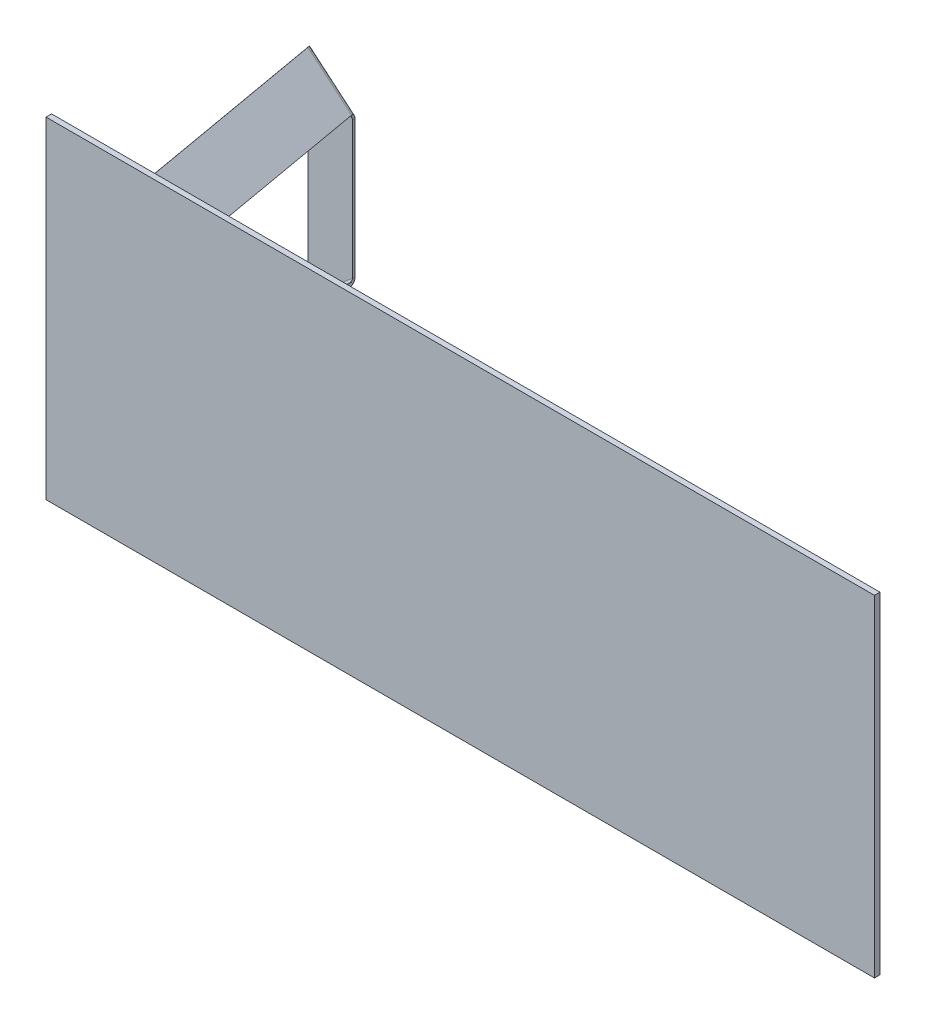
ISO-10303-21;
HEADER;
FILE_DESCRIPTION(('STEP AP214'),'2;1');
FILE_NAME('part.step','',(''),(''),'','','');
FILE_SCHEMA(('AUTOMOTIVE_DESIGN { 1 0 10303 214 1 1 1 1 }'));
ENDSEC;
DATA;
#1=APPLICATION_CONTEXT('core data for automotive mechanical design processes');
#2=APPLICATION_PROTOCOL_DEFINITION('international standard','automotive_design',2000,#1);
#3=PRODUCT_CONTEXT('',#1,'mechanical');
#4=PRODUCT('Part','Part','',(#3));
#5=PRODUCT_RELATED_PRODUCT_CATEGORY('part','',(#4));
#6=PRODUCT_DEFINITION_FORMATION('','',#4);
#7=PRODUCT_DEFINITION_CONTEXT('part definition',#1,'design');
#8=PRODUCT_DEFINITION('design','',#6,#7);
#9=PRODUCT_DEFINITION_SHAPE('','',#8);
#10=(LENGTH_UNIT() NAMED_UNIT(*) SI_UNIT(.MILLI.,.METRE.));
#11=(NAMED_UNIT(*) PLANE_ANGLE_UNIT() SI_UNIT($,.RADIAN.));
#12=(NAMED_UNIT(*) SI_UNIT($,.STERADIAN.) SOLID_ANGLE_UNIT());
#13=UNCERTAINTY_MEASURE_WITH_UNIT(LENGTH_MEASURE(1.E-05),#10,'distance_accuracy_value','');
#14=(GEOMETRIC_REPRESENTATION_CONTEXT(3) GLOBAL_UNCERTAINTY_ASSIGNED_CONTEXT((#13)) GLOBAL_UNIT_ASSIGNED_CONTEXT((#10,
#11,#12)) REPRESENTATION_CONTEXT('',''));
#15=CARTESIAN_POINT('',(0.,0.,0.));
#16=DIRECTION('',(0.,0.,1.));
#17=DIRECTION('',(1.,0.,0.));
#18=AXIS2_PLACEMENT_3D('',#15,#16,#17);
#19=CARTESIAN_POINT('',(-1395.82552863238,590.669632199509,123.420662326769));
#20=DIRECTION('',(-0.0729431107896774,0.0863637284494173,-0.993589758902859));
#21=DIRECTION('',(-0.763969998789818,-0.645251765552862,0.));
#22=AXIS2_PLACEMENT_3D('',#19,#20,#21);
#23=PLANE('',#22);
#24=DIRECTION('',(-0.763969998789818,-0.645251765552862,0.));
#25=VECTOR('',#24,1.);
#26=CARTESIAN_POINT('',(-693.30770802874,-241.102657639218,-0.452183874163709));
#27=LINE('',#26,#25);
#28=CARTESIAN_POINT('',(-565.953191350993,-133.538581998003,-0.452183874164125));
#29=VERTEX_POINT('',#28);
#30=CARTESIAN_POINT('',(-645.102645416704,-200.388491103525,-0.452183874163764));
#31=VERTEX_POINT('',#30);
#32=EDGE_CURVE('E559',#29,#31,#27,.T.);
#33=ORIENTED_EDGE('',*,*,#32,.F.);
#34=DIRECTION('',(0.641115546167312,-0.759072766906592,-0.113045968540943));
#35=VECTOR('',#34,1.);
#36=CARTESIAN_POINT('',(-1268.47101195463,698.233707840725,123.420662326769));
#37=LINE('',#36,#35);
#38=CARTESIAN_POINT('',(-568.517653535662,-130.502290930376,0.));
#39=VERTEX_POINT('',#38);
#40=EDGE_CURVE('E555',#39,#29,#37,.T.);
#41=ORIENTED_EDGE('',*,*,#40,.F.);
#42=DIRECTION('',(0.763969998789818,0.645251765552862,0.));
#43=VECTOR('',#42,1.);
#44=CARTESIAN_POINT('',(-695.872170213409,-238.066366571592,1.66533453693773E-13));
#45=LINE('',#44,#43);
#46=CARTESIAN_POINT('',(-647.667107601373,-197.352200035898,1.80411241501588E-13));
#47=VERTEX_POINT('',#46);
#48=EDGE_CURVE('E12',#47,#39,#45,.T.);
#49=ORIENTED_EDGE('',*,*,#48,.F.);
#50=DIRECTION('',(0.641115546167312,-0.759072766906592,-0.113045968540943));
#51=VECTOR('',#50,1.);
#52=CARTESIAN_POINT('',(-1347.62046602034,631.383798735203,123.420662326769));
#53=LINE('',#52,#51);
#54=EDGE_CURVE('E562',#47,#31,#53,.T.);
#55=ORIENTED_EDGE('',*,*,#54,.T.);
#56=EDGE_LOOP('',(#33,#41,#49,#55));
#57=FACE_BOUND('',#56,.T.);
#58=ADVANCED_FACE('F45',(#57),#23,.F.);
#59=CARTESIAN_POINT('',(-1425.76214597046,631.383798735202,-319.742826528724));
#60=DIRECTION('',(0.74754074595004,0.651005786871953,-0.131811602689928));
#61=DIRECTION('',(-0.173648177666935,0.,-0.984807753012208));
#62=AXIS2_PLACEMENT_3D('',#59,#60,#61);
#63=PLANE('',#62);
#64=DIRECTION('',(-0.173648177666935,0.,-0.984807753012208));
#65=VECTOR('',#64,1.);
#66=CARTESIAN_POINT('',(-723.244325366824,-200.388491103525,-443.615672729657));
#67=LINE('',#66,#65);
#68=CARTESIAN_POINT('',(-721.913441738413,-200.388491103525,-436.067856603821));
#69=VERTEX_POINT('',#68);
#70=EDGE_CURVE('E558',#31,#69,#67,.T.);
#71=ORIENTED_EDGE('',*,*,#70,.F.);
#72=ORIENTED_EDGE('',*,*,#54,.F.);
#73=DIRECTION('',(0.173648177666935,0.,0.984807753012207));
#74=VECTOR('',#73,1.);
#75=CARTESIAN_POINT('',(-725.808787551494,-197.352200035899,-443.163488855493));
#76=LINE('',#75,#74);
#77=CARTESIAN_POINT('',(-724.477903923082,-197.352200035899,-435.615672729657));
#78=VERTEX_POINT('',#77);
#79=EDGE_CURVE('E57',#78,#47,#76,.T.);
#80=ORIENTED_EDGE('',*,*,#79,.F.);
#81=CARTESIAN_POINT('',(-721.913441738413,-200.388491103525,-436.067856603821));
#82=CARTESIAN_POINT('',(-724.477903923083,-197.352200035899,-435.615672729657));
#83=B_SPLINE_CURVE_WITH_KNOTS('',1,(#81,#82),.UNSPECIFIED.,.F.,.F.,(2,2),(0.,1.),.UNSPECIFIED.);
#84=EDGE_CURVE('E561',#78,#69,#83,.F.);
#85=ORIENTED_EDGE('',*,*,#84,.T.);
#86=EDGE_LOOP('',(#71,#72,#80,#85));
#87=FACE_BOUND('',#86,.T.);
#88=ADVANCED_FACE('F592',(#87),#63,.F.);
#89=CARTESIAN_POINT('',(-725.808787551494,-202.621787056259,-443.163488855493));
#90=DIRECTION('',(0.641115546167312,-0.759072766906592,-0.113045968540943));
#91=DIRECTION('',(0.763969998789818,0.645251765552862,0.));
#92=AXIS2_PLACEMENT_3D('',#89,#90,#91);
#93=PLANE('',#92);
#94=DIRECTION('',(-0.763969998789818,-0.645251765552862,0.));
#95=VECTOR('',#94,1.);
#96=CARTESIAN_POINT('',(-721.913441738413,-200.388491103525,-436.067856603821));
#97=LINE('',#96,#95);
#98=CARTESIAN_POINT('',(-642.763987672702,-133.538581998003,-436.067856603821));
#99=VERTEX_POINT('',#98);
#100=EDGE_CURVE('E214',#99,#69,#97,.T.);
#101=ORIENTED_EDGE('',*,*,#100,.F.);
#102=DIRECTION('',(-0.173648177666935,0.,-0.984807753012208));
#103=VECTOR('',#102,1.);
#104=CARTESIAN_POINT('',(-644.015139083857,-133.538581998003,-443.163488855493));
#105=LINE('',#104,#103);
#106=EDGE_CURVE('E557',#29,#99,#105,.T.);
#107=ORIENTED_EDGE('',*,*,#106,.F.);
#108=ORIENTED_EDGE('',*,*,#32,.T.);
#109=ORIENTED_EDGE('',*,*,#70,.T.);
#110=EDGE_LOOP('',(#101,#107,#108,#109));
#111=FACE_BOUND('',#110,.T.);
#112=ADVANCED_FACE('F590',(#111),#93,.T.);
#113=CARTESIAN_POINT('',(-1346.53295968749,698.233707840724,-319.29064265456));
#114=DIRECTION('',(0.74754074595004,0.651005786871953,-0.131811602689928));
#115=DIRECTION('',(-0.173648177666935,0.,-0.984807753012208));
#116=AXIS2_PLACEMENT_3D('',#113,#114,#115);
#117=PLANE('',#116);
#118=ORIENTED_EDGE('',*,*,#40,.T.);
#119=ORIENTED_EDGE('',*,*,#106,.T.);
#120=CARTESIAN_POINT('',(-645.328449857372,-130.502290930377,-435.615672729657));
#121=CARTESIAN_POINT('',(-642.763987672703,-133.538581998003,-436.067856603821));
#122=B_SPLINE_CURVE_WITH_KNOTS('',1,(#120,#121),.UNSPECIFIED.,.F.,.F.,(2,2),(0.,1.),.UNSPECIFIED.);
#123=CARTESIAN_POINT('',(-645.328449857372,-130.502290930377,-435.615672729657));
#124=VERTEX_POINT('',#123);
#125=EDGE_CURVE('E565',#124,#99,#122,.T.);
#126=ORIENTED_EDGE('',*,*,#125,.F.);
#127=DIRECTION('',(-0.173648177666935,0.,-0.984807753012208));
#128=VECTOR('',#127,1.);
#129=CARTESIAN_POINT('',(-646.579601268527,-130.502290930377,-442.711304981329));
#130=LINE('',#129,#128);
#131=EDGE_CURVE('E66',#39,#124,#130,.T.);
#132=ORIENTED_EDGE('',*,*,#131,.F.);
#133=EDGE_LOOP('',(#118,#119,#126,#132));
#134=FACE_BOUND('',#133,.T.);
#135=ADVANCED_FACE('F581',(#134),#117,.T.);
#136=CARTESIAN_POINT('',(-728.373249736163,-199.585495988633,-442.711304981329));
#137=DIRECTION('',(0.641115546167312,-0.759072766906592,-0.113045968540943));
#138=DIRECTION('',(0.763969998789818,0.645251765552862,0.));
#139=AXIS2_PLACEMENT_3D('',#136,#137,#138);
#140=PLANE('',#139);
#141=ORIENTED_EDGE('',*,*,#131,.T.);
#142=DIRECTION('',(-0.763969998789818,-0.645251765552862,0.));
#143=VECTOR('',#142,1.);
#144=CARTESIAN_POINT('',(-724.477903923082,-197.352200035899,-435.615672729657));
#145=LINE('',#144,#143);
#146=EDGE_CURVE('E877',#124,#78,#145,.T.);
#147=ORIENTED_EDGE('',*,*,#146,.T.);
#148=ORIENTED_EDGE('',*,*,#79,.T.);
#149=ORIENTED_EDGE('',*,*,#48,.T.);
#150=EDGE_LOOP('',(#141,#147,#148,#149));
#151=FACE_BOUND('',#150,.T.);
#152=ADVANCED_FACE('F47',(#151),#140,.F.);
#153=CARTESIAN_POINT('',(-1395.82552863238,-590.669632199509,123.420662326769));
#154=DIRECTION('',(-0.0729431107896774,-0.0863637284494173,-0.993589758902859));
#155=DIRECTION('',(0.763969998789818,-0.645251765552862,0.));
#156=AXIS2_PLACEMENT_3D('',#153,#154,#155);
#157=PLANE('',#156);
#158=DIRECTION('',(0.763969998789818,-0.645251765552862,0.));
#159=VECTOR('',#158,1.);
#160=CARTESIAN_POINT('',(-693.307708028739,241.102657639218,-0.452183874163917));
#161=LINE('',#160,#159);
#162=CARTESIAN_POINT('',(-645.102645416704,200.388491103525,-0.452183874163931));
#163=VERTEX_POINT('',#162);
#164=CARTESIAN_POINT('',(-565.953191350993,133.538581998003,-0.452183874164028));
#165=VERTEX_POINT('',#164);
#166=EDGE_CURVE('E657',#163,#165,#161,.T.);
#167=ORIENTED_EDGE('',*,*,#166,.F.);
#168=DIRECTION('',(0.641115546167312,0.759072766906592,-0.113045968540943));
#169=VECTOR('',#168,1.);
#170=CARTESIAN_POINT('',(-1347.62046602034,-631.383798735203,123.420662326769));
#171=LINE('',#170,#169);
#172=CARTESIAN_POINT('',(-647.667107601373,197.352200035898,0.));
#173=VERTEX_POINT('',#172);
#174=EDGE_CURVE('E669',#173,#163,#171,.T.);
#175=ORIENTED_EDGE('',*,*,#174,.F.);
#176=DIRECTION('',(-0.763969998789818,0.645251765552862,0.));
#177=VECTOR('',#176,1.);
#178=CARTESIAN_POINT('',(-695.872170213409,238.066366571592,0.));
#179=LINE('',#178,#177);
#180=CARTESIAN_POINT('',(-568.517653535662,130.502290930376,-2.4980018054066E-13));
#181=VERTEX_POINT('',#180);
#182=EDGE_CURVE('E619',#181,#173,#179,.T.);
#183=ORIENTED_EDGE('',*,*,#182,.F.);
#184=DIRECTION('',(0.641115546167312,0.759072766906592,-0.113045968540943));
#185=VECTOR('',#184,1.);
#186=CARTESIAN_POINT('',(-1268.47101195463,-698.233707840725,123.420662326769));
#187=LINE('',#186,#185);
#188=EDGE_CURVE('E654',#181,#165,#187,.T.);
#189=ORIENTED_EDGE('',*,*,#188,.T.);
#190=EDGE_LOOP('',(#167,#175,#183,#189));
#191=FACE_BOUND('',#190,.T.);
#192=ADVANCED_FACE('F541',(#191),#157,.F.);
#193=CARTESIAN_POINT('',(-1346.53295968749,-698.233707840724,-319.290642654561));
#194=DIRECTION('',(-0.74754074595004,0.651005786871953,0.131811602689928));
#195=DIRECTION('',(-0.173648177666935,0.,-0.984807753012208));
#196=AXIS2_PLACEMENT_3D('',#193,#194,#195);
#197=PLANE('',#196);
#198=DIRECTION('',(0.173648177666935,0.,0.984807753012207));
#199=VECTOR('',#198,1.);
#200=CARTESIAN_POINT('',(-644.015139083857,133.538581998003,-443.163488855494));
#201=LINE('',#200,#199);
#202=CARTESIAN_POINT('',(-642.763987672703,133.538581998004,-436.067856603821));
#203=VERTEX_POINT('',#202);
#204=EDGE_CURVE('E628',#203,#165,#201,.T.);
#205=ORIENTED_EDGE('',*,*,#204,.T.);
#206=ORIENTED_EDGE('',*,*,#188,.F.);
#207=DIRECTION('',(-0.173648177666935,0.,-0.984807753012208));
#208=VECTOR('',#207,1.);
#209=CARTESIAN_POINT('',(-646.579601268527,130.502290930377,-442.71130498133));
#210=LINE('',#209,#208);
#211=CARTESIAN_POINT('',(-645.328449857371,130.502290930377,-435.615672729657));
#212=VERTEX_POINT('',#211);
#213=EDGE_CURVE('E125',#181,#212,#210,.T.);
#214=ORIENTED_EDGE('',*,*,#213,.T.);
#215=CARTESIAN_POINT('',(-642.763987672702,133.538581998004,-436.067856603821));
#216=CARTESIAN_POINT('',(-645.328449857372,130.502290930377,-435.615672729657));
#217=B_SPLINE_CURVE_WITH_KNOTS('',1,(#215,#216),.UNSPECIFIED.,.F.,.F.,(2,2),(0.,1.),.UNSPECIFIED.);
#218=EDGE_CURVE('E627',#212,#203,#217,.F.);
#219=ORIENTED_EDGE('',*,*,#218,.T.);
#220=EDGE_LOOP('',(#205,#206,#214,#219));
#221=FACE_BOUND('',#220,.T.);
#222=ADVANCED_FACE('F639',(#221),#197,.F.);
#223=CARTESIAN_POINT('',(-725.808787551494,202.621787056259,-443.163488855493));
#224=DIRECTION('',(0.641115546167312,0.759072766906592,-0.113045968540943));
#225=DIRECTION('',(-0.763969998789818,0.645251765552862,0.));
#226=AXIS2_PLACEMENT_3D('',#223,#224,#225);
#227=PLANE('',#226);
#228=DIRECTION('',(0.763969998789818,-0.645251765552862,0.));
#229=VECTOR('',#228,1.);
#230=CARTESIAN_POINT('',(-642.763987672702,133.538581998003,-436.067856603821));
#231=LINE('',#230,#229);
#232=CARTESIAN_POINT('',(-721.913441738413,200.388491103525,-436.067856603821));
#233=VERTEX_POINT('',#232);
#234=EDGE_CURVE('E659',#233,#203,#231,.T.);
#235=ORIENTED_EDGE('',*,*,#234,.F.);
#236=DIRECTION('',(-0.173648177666935,0.,-0.984807753012208));
#237=VECTOR('',#236,1.);
#238=CARTESIAN_POINT('',(-723.244325366824,200.388491103525,-443.615672729657));
#239=LINE('',#238,#237);
#240=EDGE_CURVE('E623',#163,#233,#239,.T.);
#241=ORIENTED_EDGE('',*,*,#240,.F.);
#242=ORIENTED_EDGE('',*,*,#166,.T.);
#243=ORIENTED_EDGE('',*,*,#204,.F.);
#244=EDGE_LOOP('',(#235,#241,#242,#243));
#245=FACE_BOUND('',#244,.T.);
#246=ADVANCED_FACE('F606',(#245),#227,.T.);
#247=CARTESIAN_POINT('',(-1425.76214597046,-631.383798735202,-319.742826528724));
#248=DIRECTION('',(-0.74754074595004,0.651005786871953,0.131811602689928));
#249=DIRECTION('',(-0.173648177666935,0.,-0.984807753012208));
#250=AXIS2_PLACEMENT_3D('',#247,#248,#249);
#251=PLANE('',#250);
#252=ORIENTED_EDGE('',*,*,#174,.T.);
#253=ORIENTED_EDGE('',*,*,#240,.T.);
#254=CARTESIAN_POINT('',(-724.477903923082,197.352200035899,-435.615672729657));
#255=CARTESIAN_POINT('',(-721.913441738413,200.388491103525,-436.067856603821));
#256=B_SPLINE_CURVE_WITH_KNOTS('',1,(#254,#255),.UNSPECIFIED.,.F.,.F.,(2,2),(0.,1.),.UNSPECIFIED.);
#257=CARTESIAN_POINT('',(-724.477903923082,197.352200035899,-435.615672729657));
#258=VERTEX_POINT('',#257);
#259=EDGE_CURVE('E118',#258,#233,#256,.T.);
#260=ORIENTED_EDGE('',*,*,#259,.F.);
#261=DIRECTION('',(-0.173648177666935,0.,-0.984807753012208));
#262=VECTOR('',#261,1.);
#263=CARTESIAN_POINT('',(-725.808787551493,197.352200035899,-443.163488855493));
#264=LINE('',#263,#262);
#265=EDGE_CURVE('E99',#173,#258,#264,.T.);
#266=ORIENTED_EDGE('',*,*,#265,.F.);
#267=EDGE_LOOP('',(#252,#253,#260,#266));
#268=FACE_BOUND('',#267,.T.);
#269=ADVANCED_FACE('F601',(#268),#251,.T.);
#270=CARTESIAN_POINT('',(-728.373249736163,199.585495988633,-442.71130498133));
#271=DIRECTION('',(0.641115546167312,0.759072766906592,-0.113045968540943));
#272=DIRECTION('',(-0.763969998789818,0.645251765552862,0.));
#273=AXIS2_PLACEMENT_3D('',#270,#271,#272);
#274=PLANE('',#273);
#275=ORIENTED_EDGE('',*,*,#265,.T.);
#276=DIRECTION('',(0.763969998789818,-0.645251765552862,0.));
#277=VECTOR('',#276,1.);
#278=CARTESIAN_POINT('',(-645.328449857371,130.502290930377,-435.615672729657));
#279=LINE('',#278,#277);
#280=EDGE_CURVE('E612',#258,#212,#279,.T.);
#281=ORIENTED_EDGE('',*,*,#280,.T.);
#282=ORIENTED_EDGE('',*,*,#213,.F.);
#283=ORIENTED_EDGE('',*,*,#182,.T.);
#284=EDGE_LOOP('',(#275,#281,#282,#283));
#285=FACE_BOUND('',#284,.T.);
#286=ADVANCED_FACE('F538',(#285),#274,.F.);
#287=CARTESIAN_POINT('',(-725.10347962866,202.621787056259,348.427919888509));
#288=DIRECTION('',(1.,0.,0.));
#289=DIRECTION('',(0.,0.,-1.));
#290=AXIS2_PLACEMENT_3D('',#287,#288,#289);
#291=PLANE('',#290);
#292=DIRECTION('',(0.,1.,0.));
#293=VECTOR('',#292,1.);
#294=CARTESIAN_POINT('',(-725.10347962866,202.621787056259,-443.163488855493));
#295=LINE('',#294,#293);
#296=CARTESIAN_POINT('',(-725.10347962866,-192.678318584066,-443.163488855493));
#297=VERTEX_POINT('',#296);
#298=CARTESIAN_POINT('',(-725.10347962866,192.678318584066,-443.163488855493));
#299=VERTEX_POINT('',#298);
#300=EDGE_CURVE('E505',#297,#299,#295,.T.);
#301=ORIENTED_EDGE('',*,*,#300,.F.);
#302=CARTESIAN_POINT('',(-725.10347962866,-192.678318584066,-439.163488855493));
#303=CARTESIAN_POINT('',(-725.10347962866,-192.678318584066,-443.163488855493));
#304=B_SPLINE_CURVE_WITH_KNOTS('',1,(#302,#303),.UNSPECIFIED.,.F.,.F.,(2,2),(0.,1.),.UNSPECIFIED.);
#305=CARTESIAN_POINT('',(-725.10347962866,-192.678318584066,-439.163488855493));
#306=VERTEX_POINT('',#305);
#307=EDGE_CURVE('E222',#306,#297,#304,.T.);
#308=ORIENTED_EDGE('',*,*,#307,.F.);
#309=DIRECTION('',(0.,-1.,0.));
#310=VECTOR('',#309,1.);
#311=CARTESIAN_POINT('',(-725.10347962866,202.621787056259,-439.163488855493));
#312=LINE('',#311,#310);
#313=CARTESIAN_POINT('',(-725.10347962866,192.678318584066,-439.163488855493));
#314=VERTEX_POINT('',#313);
#315=EDGE_CURVE('E691',#314,#306,#312,.T.);
#316=ORIENTED_EDGE('',*,*,#315,.F.);
#317=CARTESIAN_POINT('',(-725.10347962866,192.678318584066,-443.163488855493));
#318=CARTESIAN_POINT('',(-725.10347962866,192.678318584066,-439.163488855493));
#319=B_SPLINE_CURVE_WITH_KNOTS('',1,(#317,#318),.UNSPECIFIED.,.F.,.F.,(2,2),(0.,1.),.UNSPECIFIED.);
#320=EDGE_CURVE('E492',#314,#299,#319,.F.);
#321=ORIENTED_EDGE('',*,*,#320,.T.);
#322=EDGE_LOOP('',(#301,#308,#316,#321));
#323=FACE_BOUND('',#322,.T.);
#324=ADVANCED_FACE('F527',(#323),#291,.F.);
#325=CARTESIAN_POINT('',(-644.015139083857,-133.538581998003,348.427919888509));
#326=DIRECTION('',(-1.,0.,0.));
#327=DIRECTION('',(0.,0.,1.));
#328=AXIS2_PLACEMENT_3D('',#325,#326,#327);
#329=PLANE('',#328);
#330=DIRECTION('',(0.,1.,0.));
#331=VECTOR('',#330,1.);
#332=CARTESIAN_POINT('',(-644.015139083857,-133.538581998003,-443.163488855493));
#333=LINE('',#332,#331);
#334=CARTESIAN_POINT('',(-644.015139083857,-124.190819094337,-443.163488855493));
#335=VERTEX_POINT('',#334);
#336=CARTESIAN_POINT('',(-644.015139083857,124.190819094337,-443.163488855493));
#337=VERTEX_POINT('',#336);
#338=EDGE_CURVE('E497',#335,#337,#333,.T.);
#339=ORIENTED_EDGE('',*,*,#338,.T.);
#340=CARTESIAN_POINT('',(-644.015139083857,124.190819094338,-439.163488855494));
#341=CARTESIAN_POINT('',(-644.015139083857,124.190819094338,-443.163488855494));
#342=B_SPLINE_CURVE_WITH_KNOTS('',1,(#340,#341),.UNSPECIFIED.,.F.,.F.,(2,2),(0.,1.),.UNSPECIFIED.);
#343=CARTESIAN_POINT('',(-644.015139083858,124.190819094338,-439.163488855494));
#344=VERTEX_POINT('',#343);
#345=EDGE_CURVE('E685',#344,#337,#342,.T.);
#346=ORIENTED_EDGE('',*,*,#345,.F.);
#347=DIRECTION('',(0.,-1.,0.));
#348=VECTOR('',#347,1.);
#349=CARTESIAN_POINT('',(-644.015139083857,-133.538581998003,-439.163488855493));
#350=LINE('',#349,#348);
#351=CARTESIAN_POINT('',(-644.015139083857,-124.190819094337,-439.163488855493));
#352=VERTEX_POINT('',#351);
#353=EDGE_CURVE('E688',#344,#352,#350,.T.);
#354=ORIENTED_EDGE('',*,*,#353,.T.);
#355=CARTESIAN_POINT('',(-644.015139083857,-124.190819094337,-443.163488855493));
#356=CARTESIAN_POINT('',(-644.015139083857,-124.190819094337,-439.163488855493));
#357=B_SPLINE_CURVE_WITH_KNOTS('',1,(#355,#356),.UNSPECIFIED.,.F.,.F.,(2,2),(0.,1.),.UNSPECIFIED.);
#358=EDGE_CURVE('E334',#352,#335,#357,.F.);
#359=ORIENTED_EDGE('',*,*,#358,.T.);
#360=EDGE_LOOP('',(#339,#346,#354,#359));
#361=FACE_BOUND('',#360,.T.);
#362=ADVANCED_FACE('F537',(#361),#329,.F.);
#363=CARTESIAN_POINT('',(-78.1416799501202,0.,-439.163488855493));
#364=DIRECTION('',(0.,0.,-1.));
#365=DIRECTION('',(-1.,0.,0.));
#366=AXIS2_PLACEMENT_3D('',#363,#364,#365);
#367=PLANE('',#366);
#368=DIRECTION('',(-0.763969998789819,-0.645251765552861,0.));
#369=VECTOR('',#368,1.);
#370=CARTESIAN_POINT('',(-725.10347962866,-192.678318584066,-439.163488855493));
#371=LINE('',#370,#369);
#372=EDGE_CURVE('E690',#352,#306,#371,.T.);
#373=ORIENTED_EDGE('',*,*,#372,.F.);
#374=ORIENTED_EDGE('',*,*,#353,.F.);
#375=DIRECTION('',(0.763969998789819,-0.645251765552861,0.));
#376=VECTOR('',#375,1.);
#377=CARTESIAN_POINT('',(-644.015139083857,124.190819094337,-439.163488855493));
#378=LINE('',#377,#376);
#379=EDGE_CURVE('E511',#314,#344,#378,.T.);
#380=ORIENTED_EDGE('',*,*,#379,.F.);
#381=ORIENTED_EDGE('',*,*,#315,.T.);
#382=EDGE_LOOP('',(#373,#374,#380,#381));
#383=FACE_BOUND('',#382,.T.);
#384=ADVANCED_FACE('F933',(#383),#367,.F.);
#385=CARTESIAN_POINT('',(-78.1416799501202,0.,-443.163488855493));
#386=DIRECTION('',(0.,0.,-1.));
#387=DIRECTION('',(-1.,0.,0.));
#388=AXIS2_PLACEMENT_3D('',#385,#386,#387);
#389=PLANE('',#388);
#390=ORIENTED_EDGE('',*,*,#338,.F.);
#391=DIRECTION('',(-0.763969998789819,-0.645251765552861,0.));
#392=VECTOR('',#391,1.);
#393=CARTESIAN_POINT('',(-725.10347962866,-192.678318584066,-443.163488855493));
#394=LINE('',#393,#392);
#395=EDGE_CURVE('E516',#335,#297,#394,.T.);
#396=ORIENTED_EDGE('',*,*,#395,.T.);
#397=ORIENTED_EDGE('',*,*,#300,.T.);
#398=DIRECTION('',(0.763969998789819,-0.645251765552861,0.));
#399=VECTOR('',#398,1.);
#400=CARTESIAN_POINT('',(-644.015139083857,124.190819094337,-443.163488855493));
#401=LINE('',#400,#399);
#402=EDGE_CURVE('E508',#299,#337,#401,.T.);
#403=ORIENTED_EDGE('',*,*,#402,.T.);
#404=EDGE_LOOP('',(#390,#396,#397,#403));
#405=FACE_BOUND('',#404,.T.);
#406=ADVANCED_FACE('F437',(#405),#389,.T.);
#407=CARTESIAN_POINT('',(-724.500859207146,198.3528355324,-441.619788063451));
#408=CARTESIAN_POINT('',(-723.842879285084,198.960535789774,-440.969442850576));
#409=CARTESIAN_POINT('',(-723.273289684566,199.463657698105,-440.133666088817));
#410=CARTESIAN_POINT('',(-722.39070877921,200.166017667264,-438.229368362291));
#411=CARTESIAN_POINT('',(-722.078239773873,200.364712015259,-437.162142781668));
#412=CARTESIAN_POINT('',(-721.913441738413,200.388491103525,-436.067856603821));
#413=CARTESIAN_POINT('',(-726.024944715271,196.548337403208,-438.391638459472));
#414=CARTESIAN_POINT('',(-725.653725891782,196.816517201056,-438.066467912409));
#415=CARTESIAN_POINT('',(-725.326715934707,197.032426768437,-437.648577472155));
#416=CARTESIAN_POINT('',(-724.800981462755,197.312285035392,-436.696428608892));
#417=CARTESIAN_POINT('',(-724.602533364974,197.375978973568,-436.162812353429));
#418=CARTESIAN_POINT('',(-724.477903923082,197.352200035899,-435.615672729657));
#419=B_SPLINE_SURFACE_WITH_KNOTS('',1,3,((#407,#408,#409,#410,#411,#412),(#413,#414,#415,#416,
#417,#418)),.UNSPECIFIED.,.F.,.F.,.F.,(2,2),(4,2,4),(0.,1.),(0.,0.5,1.),.UNSPECIFIED.);
#420=CARTESIAN_POINT('',(-726.024944715271,196.548337403208,-438.391638459472));
#421=CARTESIAN_POINT('',(-724.500859207146,198.3528355324,-441.619788063451));
#422=B_SPLINE_CURVE_WITH_KNOTS('',1,(#420,#421),.UNSPECIFIED.,.F.,.F.,(2,2),(0.,1.),.UNSPECIFIED.);
#423=CARTESIAN_POINT('',(-726.024944715271,196.548337403209,-438.391638459472));
#424=VERTEX_POINT('',#423);
#425=CARTESIAN_POINT('',(-724.50085880008,198.35283590836,-441.619787661108));
#426=VERTEX_POINT('',#425);
#427=EDGE_CURVE('E472',#424,#426,#422,.T.);
#428=CARTESIAN_POINT('',(-726.024944715271,196.548337403208,-438.391638459472));
#429=CARTESIAN_POINT('',(-725.653725891782,196.816517201056,-438.066467912409));
#430=CARTESIAN_POINT('',(-725.326715934707,197.032426768437,-437.648577472155));
#431=CARTESIAN_POINT('',(-724.800981462755,197.312285035392,-436.696428608892));
#432=CARTESIAN_POINT('',(-724.602533364974,197.375978973568,-436.162812353429));
#433=CARTESIAN_POINT('',(-724.477903923082,197.352200035899,-435.615672729657));
#434=B_SPLINE_CURVE_WITH_KNOTS('',3,(#428,#429,#430,#431,#432,#433),.UNSPECIFIED.,.F.,.F.,(4,2,
4),(0.,0.5,1.),.UNSPECIFIED.);
#435=EDGE_CURVE('E766',#424,#258,#434,.T.);
#436=CARTESIAN_POINT('',(-721.913441738413,200.388491103525,-436.067856603821));
#437=CARTESIAN_POINT('',(-722.078239773873,200.364712015259,-437.162142781668));
#438=CARTESIAN_POINT('',(-722.39070877921,200.166017667264,-438.229368362291));
#439=CARTESIAN_POINT('',(-723.273289684566,199.463657698105,-440.133666088817));
#440=CARTESIAN_POINT('',(-723.842879285084,198.960535789774,-440.969442850576));
#441=CARTESIAN_POINT('',(-724.500859207146,198.3528355324,-441.619788063451));
#442=B_SPLINE_CURVE_WITH_KNOTS('',3,(#436,#437,#438,#439,#440,#441),.UNSPECIFIED.,.F.,.F.,(4,2,
4),(0.,0.5,1.),.UNSPECIFIED.);
#443=EDGE_CURVE('E418',#426,#233,#442,.F.);
#444=ORIENTED_EDGE('',*,*,#427,.F.);
#445=ORIENTED_EDGE('',*,*,#435,.T.);
#446=ORIENTED_EDGE('',*,*,#259,.T.);
#447=ORIENTED_EDGE('',*,*,#443,.F.);
#448=EDGE_LOOP('',(#444,#445,#446,#447));
#449=FACE_BOUND('',#448,.T.);
#450=ADVANCED_FACE('F425',(#449),#419,.T.);
#451=CARTESIAN_POINT('',(-642.763987672702,133.538581998004,-436.067856603821));
#452=CARTESIAN_POINT('',(-642.921106456477,133.515910966657,-437.111151281976));
#453=CARTESIAN_POINT('',(-643.211832395685,133.334762424285,-438.128625611076));
#454=CARTESIAN_POINT('',(-643.621229841166,133.013396621119,-439.046657105925));
#455=CARTESIAN_POINT('',(-645.328449857372,130.502290930377,-435.615672729657));
#456=CARTESIAN_POINT('',(-645.447270911669,130.524961644464,-436.137312768782));
#457=CARTESIAN_POINT('',(-645.632831234572,130.468332445002,-436.646063656768));
#458=CARTESIAN_POINT('',(-645.877789854524,130.341657863152,-437.105072980709));
#459=B_SPLINE_SURFACE_WITH_KNOTS('',1,3,((#451,#452,#453,#454),(#455,#456,#457,#458)),
.UNSPECIFIED.,.F.,.F.,.F.,(2,2),(4,4),(0.,1.),(0.,1.),.UNSPECIFIED.);
#460=CARTESIAN_POINT('',(-645.328449857372,130.502290930377,-435.615672729657));
#461=CARTESIAN_POINT('',(-645.447270911669,130.524961644464,-436.137312768782));
#462=CARTESIAN_POINT('',(-645.632831234572,130.468332445002,-436.646063656768));
#463=CARTESIAN_POINT('',(-645.877789854524,130.341657863152,-437.105072980709));
#464=B_SPLINE_CURVE_WITH_KNOTS('',3,(#460,#461,#462,#463),.UNSPECIFIED.,.F.,.F.,(4,4),(0.,1.),.UNSPECIFIED.);
#465=CARTESIAN_POINT('',(-645.877789854524,130.341657863152,-437.105072980709));
#466=VERTEX_POINT('',#465);
#467=EDGE_CURVE('E377',#212,#466,#464,.T.);
#468=CARTESIAN_POINT('',(-645.877789854524,130.341657863152,-437.105072980709));
#469=CARTESIAN_POINT('',(-643.621229841166,133.013396621119,-439.046657105925));
#470=B_SPLINE_CURVE_WITH_KNOTS('',1,(#468,#469),.UNSPECIFIED.,.F.,.F.,(2,2),(0.,1.),.UNSPECIFIED.);
#471=CARTESIAN_POINT('',(-643.621229575509,133.013396829653,-439.046656510216));
#472=VERTEX_POINT('',#471);
#473=EDGE_CURVE('E738',#466,#472,#470,.T.);
#474=CARTESIAN_POINT('',(-643.621229841166,133.013396621119,-439.046657105925));
#475=CARTESIAN_POINT('',(-643.211832395685,133.334762424285,-438.128625611076));
#476=CARTESIAN_POINT('',(-642.921106456477,133.515910966657,-437.111151281976));
#477=CARTESIAN_POINT('',(-642.763987672702,133.538581998004,-436.067856603821));
#478=B_SPLINE_CURVE_WITH_KNOTS('',3,(#474,#475,#476,#477),.UNSPECIFIED.,.F.,.F.,(4,4),(0.,1.),.UNSPECIFIED.);
#479=EDGE_CURVE('E367',#203,#472,#478,.F.);
#480=ORIENTED_EDGE('',*,*,#218,.F.);
#481=ORIENTED_EDGE('',*,*,#467,.T.);
#482=ORIENTED_EDGE('',*,*,#473,.T.);
#483=ORIENTED_EDGE('',*,*,#479,.F.);
#484=EDGE_LOOP('',(#480,#481,#482,#483));
#485=FACE_BOUND('',#484,.T.);
#486=ADVANCED_FACE('F436',(#485),#459,.T.);
#487=CARTESIAN_POINT('',(-643.621229841166,133.013396621119,-439.046657105925));
#488=CARTESIAN_POINT('',(-643.378912425637,131.906999342599,-440.287499915166));
#489=CARTESIAN_POINT('',(-643.353976899787,130.544422777904,-441.338278676482));
#490=CARTESIAN_POINT('',(-643.558654606275,127.516688965748,-442.777487669004));
#491=CARTESIAN_POINT('',(-643.786195602092,125.85518336552,-443.163488855494));
#492=CARTESIAN_POINT('',(-644.015139083857,124.190819094338,-443.163488855494));
#493=CARTESIAN_POINT('',(-645.877789854524,130.341657863152,-437.105072980709));
#494=CARTESIAN_POINT('',(-645.413308228835,129.498577053443,-437.725371115766));
#495=CARTESIAN_POINT('',(-645.057628253164,128.527320939737,-438.250883765988));
#496=CARTESIAN_POINT('',(-644.473431975737,126.433604031851,-438.970488262249));
#497=CARTESIAN_POINT('',(-644.244037077568,125.312827970031,-439.163488855494));
#498=CARTESIAN_POINT('',(-644.015139083857,124.190819094338,-439.163488855494));
#499=B_SPLINE_SURFACE_WITH_KNOTS('',1,3,((#487,#488,#489,#490,#491,#492),(#493,#494,#495,#496,
#497,#498)),.UNSPECIFIED.,.F.,.F.,.F.,(2,2),(4,2,4),(0.,1.),(0.,0.5,1.),.UNSPECIFIED.);
#500=CARTESIAN_POINT('',(-645.877789854524,130.341657863152,-437.105072980709));
#501=CARTESIAN_POINT('',(-645.413308228835,129.498577053443,-437.725371115766));
#502=CARTESIAN_POINT('',(-645.057628253164,128.527320939737,-438.250883765988));
#503=CARTESIAN_POINT('',(-644.473431975737,126.433604031851,-438.970488262249));
#504=CARTESIAN_POINT('',(-644.244037077568,125.312827970031,-439.163488855494));
#505=CARTESIAN_POINT('',(-644.015139083857,124.190819094338,-439.163488855494));
#506=B_SPLINE_CURVE_WITH_KNOTS('',3,(#500,#501,#502,#503,#504,#505),.UNSPECIFIED.,.F.,.F.,(4,2,
4),(0.,0.5,1.),.UNSPECIFIED.);
#507=EDGE_CURVE('E721',#466,#344,#506,.T.);
#508=CARTESIAN_POINT('',(-644.015139083857,124.190819094338,-443.163488855494));
#509=CARTESIAN_POINT('',(-643.786195602092,125.85518336552,-443.163488855494));
#510=CARTESIAN_POINT('',(-643.558654606275,127.516688965748,-442.777487669004));
#511=CARTESIAN_POINT('',(-643.353976899787,130.544422777904,-441.338278676482));
#512=CARTESIAN_POINT('',(-643.378912425637,131.906999342599,-440.287499915166));
#513=CARTESIAN_POINT('',(-643.621229841166,133.013396621119,-439.046657105925));
#514=B_SPLINE_CURVE_WITH_KNOTS('',3,(#508,#509,#510,#511,#512,#513),.UNSPECIFIED.,.F.,.F.,(4,2,
4),(0.,0.5,1.),.UNSPECIFIED.);
#515=EDGE_CURVE('E142',#472,#337,#514,.F.);
#516=ORIENTED_EDGE('',*,*,#473,.F.);
#517=ORIENTED_EDGE('',*,*,#507,.T.);
#518=ORIENTED_EDGE('',*,*,#345,.T.);
#519=ORIENTED_EDGE('',*,*,#515,.F.);
#520=EDGE_LOOP('',(#516,#517,#518,#519));
#521=FACE_BOUND('',#520,.T.);
#522=ADVANCED_FACE('F390',(#521),#499,.T.);
#523=CARTESIAN_POINT('',(-725.10347962866,192.678318584066,-443.163488855493));
#524=CARTESIAN_POINT('',(-724.967608369028,193.666070094911,-443.163488855493));
#525=CARTESIAN_POINT('',(-724.831841489274,194.653608710112,-443.029388217119));
#526=CARTESIAN_POINT('',(-724.613876622141,196.565350354887,-442.506165604974));
#527=CARTESIAN_POINT('',(-724.531858181223,197.489251492526,-442.117156856251));
#528=CARTESIAN_POINT('',(-724.500859207146,198.3528355324,-441.619788063451));
#529=CARTESIAN_POINT('',(-725.10347962866,192.678318584066,-439.163488855493));
#530=CARTESIAN_POINT('',(-725.239347497558,193.344313739173,-439.163488855493));
#531=CARTESIAN_POINT('',(-725.375252324756,194.010217095414,-439.096438536306));
#532=CARTESIAN_POINT('',(-725.673861656979,195.310341366127,-438.834827230234));
#533=CARTESIAN_POINT('',(-725.836642012166,195.944424434257,-438.640316649831));
#534=CARTESIAN_POINT('',(-726.024944715271,196.548337403208,-438.391638459472));
#535=B_SPLINE_SURFACE_WITH_KNOTS('',1,3,((#523,#524,#525,#526,#527,#528),(#529,#530,#531,#532,
#533,#534)),.UNSPECIFIED.,.F.,.F.,.F.,(2,2),(4,2,4),(0.,1.),(0.,0.5,1.),.UNSPECIFIED.);
#536=CARTESIAN_POINT('',(-725.10347962866,192.678318584066,-439.163488855493));
#537=CARTESIAN_POINT('',(-725.239347497558,193.344313739173,-439.163488855493));
#538=CARTESIAN_POINT('',(-725.375252324756,194.010217095414,-439.096438536306));
#539=CARTESIAN_POINT('',(-725.673861656979,195.310341366127,-438.834827230234));
#540=CARTESIAN_POINT('',(-725.836642012166,195.944424434257,-438.640316649831));
#541=CARTESIAN_POINT('',(-726.024944715271,196.548337403208,-438.391638459472));
#542=B_SPLINE_CURVE_WITH_KNOTS('',3,(#536,#537,#538,#539,#540,#541),.UNSPECIFIED.,.F.,.F.,(4,2,
4),(0.,0.5,1.),.UNSPECIFIED.);
#543=EDGE_CURVE('E765',#314,#424,#542,.T.);
#544=CARTESIAN_POINT('',(-724.500859207146,198.3528355324,-441.619788063451));
#545=CARTESIAN_POINT('',(-724.531858181223,197.489251492526,-442.117156856251));
#546=CARTESIAN_POINT('',(-724.613876622141,196.565350354887,-442.506165604974));
#547=CARTESIAN_POINT('',(-724.831841489274,194.653608710112,-443.029388217119));
#548=CARTESIAN_POINT('',(-724.967608369028,193.666070094911,-443.163488855493));
#549=CARTESIAN_POINT('',(-725.10347962866,192.678318584066,-443.163488855493));
#550=B_SPLINE_CURVE_WITH_KNOTS('',3,(#544,#545,#546,#547,#548,#549),.UNSPECIFIED.,.F.,.F.,(4,2,
4),(0.,0.5,1.),.UNSPECIFIED.);
#551=EDGE_CURVE('E764',#299,#426,#550,.F.);
#552=ORIENTED_EDGE('',*,*,#543,.T.);
#553=ORIENTED_EDGE('',*,*,#427,.T.);
#554=ORIENTED_EDGE('',*,*,#551,.F.);
#555=ORIENTED_EDGE('',*,*,#320,.F.);
#556=EDGE_LOOP('',(#552,#553,#554,#555));
#557=FACE_BOUND('',#556,.T.);
#558=ADVANCED_FACE('F441',(#557),#535,.T.);
#559=CARTESIAN_POINT('',(177.531336212191,-569.690242345546,-435.163488855495));
#560=DIRECTION('',(-0.763969998789818,0.645251765552862,0.));
#561=DIRECTION('',(-0.645251765552862,-0.763969998789818,0.));
#562=AXIS2_PLACEMENT_3D('',#559,#560,#561);
#563=CYLINDRICAL_SURFACE('',#562,8.00000000000006);
#564=ORIENTED_EDGE('',*,*,#402,.F.);
#565=ORIENTED_EDGE('',*,*,#551,.T.);
#566=ORIENTED_EDGE('',*,*,#443,.T.);
#567=ORIENTED_EDGE('',*,*,#234,.T.);
#568=ORIENTED_EDGE('',*,*,#479,.T.);
#569=ORIENTED_EDGE('',*,*,#515,.T.);
#570=EDGE_LOOP('',(#564,#565,#566,#567,#568,#569));
#571=FACE_BOUND('',#570,.T.);
#572=ADVANCED_FACE('F294',(#571),#563,.T.);
#573=CARTESIAN_POINT('',(177.531336212191,-569.690242345546,-435.163488855495));
#574=DIRECTION('',(-0.763969998789818,0.645251765552862,0.));
#575=DIRECTION('',(-0.645251765552862,-0.763969998789818,0.));
#576=AXIS2_PLACEMENT_3D('',#573,#574,#575);
#577=CYLINDRICAL_SURFACE('',#576,4.00000000000005);
#578=ORIENTED_EDGE('',*,*,#379,.T.);
#579=ORIENTED_EDGE('',*,*,#507,.F.);
#580=ORIENTED_EDGE('',*,*,#467,.F.);
#581=ORIENTED_EDGE('',*,*,#280,.F.);
#582=ORIENTED_EDGE('',*,*,#435,.F.);
#583=ORIENTED_EDGE('',*,*,#543,.F.);
#584=EDGE_LOOP('',(#578,#579,#580,#581,#582,#583));
#585=FACE_BOUND('',#584,.T.);
#586=ADVANCED_FACE('F382',(#585),#577,.F.);
#587=CARTESIAN_POINT('',(-643.621229841166,-133.013396621119,-439.046657105924));
#588=CARTESIAN_POINT('',(-643.211832395685,-133.334762424285,-438.128625611075));
#589=CARTESIAN_POINT('',(-642.921106456478,-133.515910966657,-437.111151281977));
#590=CARTESIAN_POINT('',(-642.763987672703,-133.538581998003,-436.067856603821));
#591=CARTESIAN_POINT('',(-645.877789854524,-130.341657863152,-437.105072980709));
#592=CARTESIAN_POINT('',(-645.632831234573,-130.468332445002,-436.646063656769));
#593=CARTESIAN_POINT('',(-645.447270911669,-130.524961644464,-436.137312768782));
#594=CARTESIAN_POINT('',(-645.328449857372,-130.502290930377,-435.615672729657));
#595=B_SPLINE_SURFACE_WITH_KNOTS('',1,3,((#587,#588,#589,#590),(#591,#592,#593,#594)),
.UNSPECIFIED.,.F.,.F.,.F.,(2,2),(4,4),(0.,1.),(0.,1.),.UNSPECIFIED.);
#596=CARTESIAN_POINT('',(-645.877789854524,-130.341657863152,-437.105072980709));
#597=CARTESIAN_POINT('',(-643.621229841166,-133.013396621119,-439.046657105924));
#598=B_SPLINE_CURVE_WITH_KNOTS('',1,(#596,#597),.UNSPECIFIED.,.F.,.F.,(2,2),(0.,1.),.UNSPECIFIED.);
#599=CARTESIAN_POINT('',(-645.877789854525,-130.341657863152,-437.105072980709));
#600=VERTEX_POINT('',#599);
#601=CARTESIAN_POINT('',(-643.621229575509,-133.013396829653,-439.046656510215));
#602=VERTEX_POINT('',#601);
#603=EDGE_CURVE('E206',#600,#602,#598,.T.);
#604=CARTESIAN_POINT('',(-645.877789854524,-130.341657863152,-437.105072980709));
#605=CARTESIAN_POINT('',(-645.632831234573,-130.468332445002,-436.646063656769));
#606=CARTESIAN_POINT('',(-645.447270911669,-130.524961644464,-436.137312768782));
#607=CARTESIAN_POINT('',(-645.328449857372,-130.502290930377,-435.615672729657));
#608=B_SPLINE_CURVE_WITH_KNOTS('',3,(#604,#605,#606,#607),.UNSPECIFIED.,.F.,.F.,(4,4),(0.,1.),.UNSPECIFIED.);
#609=EDGE_CURVE('E768',#600,#124,#608,.T.);
#610=CARTESIAN_POINT('',(-642.763987672703,-133.538581998003,-436.067856603821));
#611=CARTESIAN_POINT('',(-642.921106456478,-133.515910966657,-437.111151281977));
#612=CARTESIAN_POINT('',(-643.211832395685,-133.334762424285,-438.128625611075));
#613=CARTESIAN_POINT('',(-643.621229841166,-133.013396621119,-439.046657105924));
#614=B_SPLINE_CURVE_WITH_KNOTS('',3,(#610,#611,#612,#613),.UNSPECIFIED.,.F.,.F.,(4,4),(0.,1.),.UNSPECIFIED.);
#615=EDGE_CURVE('E215',#602,#99,#614,.F.);
#616=ORIENTED_EDGE('',*,*,#603,.F.);
#617=ORIENTED_EDGE('',*,*,#609,.T.);
#618=ORIENTED_EDGE('',*,*,#125,.T.);
#619=ORIENTED_EDGE('',*,*,#615,.F.);
#620=EDGE_LOOP('',(#616,#617,#618,#619));
#621=FACE_BOUND('',#620,.T.);
#622=ADVANCED_FACE('F290',(#621),#595,.T.);
#623=CARTESIAN_POINT('',(-721.913441738413,-200.388491103525,-436.067856603821));
#624=CARTESIAN_POINT('',(-722.078239773873,-200.364712015259,-437.162142781668));
#625=CARTESIAN_POINT('',(-722.39070877921,-200.166017667264,-438.229368362291));
#626=CARTESIAN_POINT('',(-723.273289684566,-199.463657698105,-440.133666088817));
#627=CARTESIAN_POINT('',(-723.842879285084,-198.960535789774,-440.969442850576));
#628=CARTESIAN_POINT('',(-724.500859207146,-198.3528355324,-441.619788063451));
#629=CARTESIAN_POINT('',(-724.477903923083,-197.352200035899,-435.615672729657));
#630=CARTESIAN_POINT('',(-724.602533364974,-197.375978973568,-436.162812353428));
#631=CARTESIAN_POINT('',(-724.800981462755,-197.312285035392,-436.696428608892));
#632=CARTESIAN_POINT('',(-725.326715934707,-197.032426768437,-437.648577472155));
#633=CARTESIAN_POINT('',(-725.653725891781,-196.816517201056,-438.066467912409));
#634=CARTESIAN_POINT('',(-726.024944715271,-196.548337403208,-438.391638459472));
#635=B_SPLINE_SURFACE_WITH_KNOTS('',1,3,((#623,#624,#625,#626,#627,#628),(#629,#630,#631,#632,
#633,#634)),.UNSPECIFIED.,.F.,.F.,.F.,(2,2),(4,2,4),(0.,1.),(0.,0.5,1.),.UNSPECIFIED.);
#636=CARTESIAN_POINT('',(-724.477903923083,-197.352200035899,-435.615672729657));
#637=CARTESIAN_POINT('',(-724.602533364974,-197.375978973568,-436.162812353428));
#638=CARTESIAN_POINT('',(-724.800981462755,-197.312285035392,-436.696428608892));
#639=CARTESIAN_POINT('',(-725.326715934707,-197.032426768437,-437.648577472155));
#640=CARTESIAN_POINT('',(-725.653725891781,-196.816517201056,-438.066467912409));
#641=CARTESIAN_POINT('',(-726.024944715271,-196.548337403208,-438.391638459472));
#642=B_SPLINE_CURVE_WITH_KNOTS('',3,(#636,#637,#638,#639,#640,#641),.UNSPECIFIED.,.F.,.F.,(4,2,
4),(0.,0.5,1.),.UNSPECIFIED.);
#643=CARTESIAN_POINT('',(-726.024944715271,-196.548337403208,-438.391638459472));
#644=VERTEX_POINT('',#643);
#645=EDGE_CURVE('E201',#78,#644,#642,.T.);
#646=CARTESIAN_POINT('',(-726.024944715271,-196.548337403208,-438.391638459472));
#647=CARTESIAN_POINT('',(-724.500859207146,-198.3528355324,-441.619788063451));
#648=B_SPLINE_CURVE_WITH_KNOTS('',1,(#646,#647),.UNSPECIFIED.,.F.,.F.,(2,2),(0.,1.),.UNSPECIFIED.);
#649=CARTESIAN_POINT('',(-724.50085880008,-198.35283590836,-441.619787661108));
#650=VERTEX_POINT('',#649);
#651=EDGE_CURVE('E194',#644,#650,#648,.T.);
#652=CARTESIAN_POINT('',(-724.500859207146,-198.3528355324,-441.619788063451));
#653=CARTESIAN_POINT('',(-723.842879285084,-198.960535789774,-440.969442850576));
#654=CARTESIAN_POINT('',(-723.273289684566,-199.463657698105,-440.133666088817));
#655=CARTESIAN_POINT('',(-722.39070877921,-200.166017667264,-438.229368362291));
#656=CARTESIAN_POINT('',(-722.078239773873,-200.364712015259,-437.162142781668));
#657=CARTESIAN_POINT('',(-721.913441738413,-200.388491103525,-436.067856603821));
#658=B_SPLINE_CURVE_WITH_KNOTS('',3,(#652,#653,#654,#655,#656,#657),.UNSPECIFIED.,.F.,.F.,(4,2,
4),(0.,0.5,1.),.UNSPECIFIED.);
#659=EDGE_CURVE('E198',#69,#650,#658,.F.);
#660=ORIENTED_EDGE('',*,*,#84,.F.);
#661=ORIENTED_EDGE('',*,*,#645,.T.);
#662=ORIENTED_EDGE('',*,*,#651,.T.);
#663=ORIENTED_EDGE('',*,*,#659,.F.);
#664=EDGE_LOOP('',(#660,#661,#662,#663));
#665=FACE_BOUND('',#664,.T.);
#666=ADVANCED_FACE('F197',(#665),#635,.T.);
#667=CARTESIAN_POINT('',(-724.500859207146,-198.3528355324,-441.619788063451));
#668=CARTESIAN_POINT('',(-724.531858181223,-197.489251492526,-442.117156856251));
#669=CARTESIAN_POINT('',(-724.613876622141,-196.565350354887,-442.506165604974));
#670=CARTESIAN_POINT('',(-724.831841489274,-194.653608710112,-443.029388217119));
#671=CARTESIAN_POINT('',(-724.967608369028,-193.666070094911,-443.163488855493));
#672=CARTESIAN_POINT('',(-725.10347962866,-192.678318584066,-443.163488855493));
#673=CARTESIAN_POINT('',(-726.024944715271,-196.548337403208,-438.391638459472));
#674=CARTESIAN_POINT('',(-725.836642012166,-195.944424434257,-438.640316649831));
#675=CARTESIAN_POINT('',(-725.673861656979,-195.310341366127,-438.834827230234));
#676=CARTESIAN_POINT('',(-725.375252324756,-194.010217095414,-439.096438536306));
#677=CARTESIAN_POINT('',(-725.239347497557,-193.344313739173,-439.163488855493));
#678=CARTESIAN_POINT('',(-725.10347962866,-192.678318584066,-439.163488855493));
#679=B_SPLINE_SURFACE_WITH_KNOTS('',1,3,((#667,#668,#669,#670,#671,#672),(#673,#674,#675,#676,
#677,#678)),.UNSPECIFIED.,.F.,.F.,.F.,(2,2),(4,2,4),(0.,1.),(0.,0.5,1.),.UNSPECIFIED.);
#680=CARTESIAN_POINT('',(-726.024944715271,-196.548337403208,-438.391638459472));
#681=CARTESIAN_POINT('',(-725.836642012166,-195.944424434257,-438.640316649831));
#682=CARTESIAN_POINT('',(-725.673861656979,-195.310341366127,-438.834827230234));
#683=CARTESIAN_POINT('',(-725.375252324756,-194.010217095414,-439.096438536306));
#684=CARTESIAN_POINT('',(-725.239347497557,-193.344313739173,-439.163488855493));
#685=CARTESIAN_POINT('',(-725.10347962866,-192.678318584066,-439.163488855493));
#686=B_SPLINE_CURVE_WITH_KNOTS('',3,(#680,#681,#682,#683,#684,#685),.UNSPECIFIED.,.F.,.F.,(4,2,
4),(0.,0.5,1.),.UNSPECIFIED.);
#687=EDGE_CURVE('E770',#644,#306,#686,.T.);
#688=CARTESIAN_POINT('',(-725.10347962866,-192.678318584066,-443.163488855493));
#689=CARTESIAN_POINT('',(-724.967608369028,-193.666070094911,-443.163488855493));
#690=CARTESIAN_POINT('',(-724.831841489274,-194.653608710112,-443.029388217119));
#691=CARTESIAN_POINT('',(-724.613876622141,-196.565350354887,-442.506165604974));
#692=CARTESIAN_POINT('',(-724.531858181223,-197.489251492526,-442.117156856251));
#693=CARTESIAN_POINT('',(-724.500859207146,-198.3528355324,-441.619788063451));
#694=B_SPLINE_CURVE_WITH_KNOTS('',3,(#688,#689,#690,#691,#692,#693),.UNSPECIFIED.,.F.,.F.,(4,2,
4),(0.,0.5,1.),.UNSPECIFIED.);
#695=EDGE_CURVE('E133',#650,#297,#694,.F.);
#696=ORIENTED_EDGE('',*,*,#651,.F.);
#697=ORIENTED_EDGE('',*,*,#687,.T.);
#698=ORIENTED_EDGE('',*,*,#307,.T.);
#699=ORIENTED_EDGE('',*,*,#695,.F.);
#700=EDGE_LOOP('',(#696,#697,#698,#699));
#701=FACE_BOUND('',#700,.T.);
#702=ADVANCED_FACE('F220',(#701),#679,.T.);
#703=CARTESIAN_POINT('',(-644.015139083857,-124.190819094337,-443.163488855493));
#704=CARTESIAN_POINT('',(-643.786195602092,-125.85518336552,-443.163488855493));
#705=CARTESIAN_POINT('',(-643.558654606275,-127.516688965748,-442.777487669004));
#706=CARTESIAN_POINT('',(-643.353976899787,-130.544422777905,-441.338278676482));
#707=CARTESIAN_POINT('',(-643.378912425637,-131.906999342599,-440.287499915165));
#708=CARTESIAN_POINT('',(-643.621229841166,-133.013396621119,-439.046657105924));
#709=CARTESIAN_POINT('',(-644.015139083857,-124.190819094337,-439.163488855493));
#710=CARTESIAN_POINT('',(-644.244037077568,-125.31282797003,-439.163488855493));
#711=CARTESIAN_POINT('',(-644.473431975737,-126.433604031851,-438.970488262249));
#712=CARTESIAN_POINT('',(-645.057628253164,-128.527320939737,-438.250883765988));
#713=CARTESIAN_POINT('',(-645.413308228835,-129.498577053443,-437.725371115766));
#714=CARTESIAN_POINT('',(-645.877789854524,-130.341657863152,-437.105072980709));
#715=B_SPLINE_SURFACE_WITH_KNOTS('',1,3,((#703,#704,#705,#706,#707,#708),(#709,#710,#711,#712,
#713,#714)),.UNSPECIFIED.,.F.,.F.,.F.,(2,2),(4,2,4),(0.,1.),(0.,0.5,1.),.UNSPECIFIED.);
#716=CARTESIAN_POINT('',(-644.015139083857,-124.190819094337,-439.163488855493));
#717=CARTESIAN_POINT('',(-644.244037077568,-125.31282797003,-439.163488855493));
#718=CARTESIAN_POINT('',(-644.473431975737,-126.433604031851,-438.970488262249));
#719=CARTESIAN_POINT('',(-645.057628253164,-128.527320939737,-438.250883765988));
#720=CARTESIAN_POINT('',(-645.413308228835,-129.498577053443,-437.725371115766));
#721=CARTESIAN_POINT('',(-645.877789854524,-130.341657863152,-437.105072980709));
#722=B_SPLINE_CURVE_WITH_KNOTS('',3,(#716,#717,#718,#719,#720,#721),.UNSPECIFIED.,.F.,.F.,(4,2,
4),(0.,0.5,1.),.UNSPECIFIED.);
#723=EDGE_CURVE('E225',#352,#600,#722,.T.);
#724=CARTESIAN_POINT('',(-643.621229841166,-133.013396621119,-439.046657105924));
#725=CARTESIAN_POINT('',(-643.378912425637,-131.906999342599,-440.287499915165));
#726=CARTESIAN_POINT('',(-643.353976899787,-130.544422777905,-441.338278676482));
#727=CARTESIAN_POINT('',(-643.558654606275,-127.516688965748,-442.777487669004));
#728=CARTESIAN_POINT('',(-643.786195602092,-125.85518336552,-443.163488855493));
#729=CARTESIAN_POINT('',(-644.015139083857,-124.190819094337,-443.163488855493));
#730=B_SPLINE_CURVE_WITH_KNOTS('',3,(#724,#725,#726,#727,#728,#729),.UNSPECIFIED.,.F.,.F.,(4,2,
4),(0.,0.5,1.),.UNSPECIFIED.);
#731=EDGE_CURVE('E207',#335,#602,#730,.F.);
#732=ORIENTED_EDGE('',*,*,#723,.T.);
#733=ORIENTED_EDGE('',*,*,#603,.T.);
#734=ORIENTED_EDGE('',*,*,#731,.F.);
#735=ORIENTED_EDGE('',*,*,#358,.F.);
#736=EDGE_LOOP('',(#732,#733,#734,#735));
#737=FACE_BOUND('',#736,.T.);
#738=ADVANCED_FACE('F246',(#737),#715,.T.);
#739=CARTESIAN_POINT('',(-1434.01433370486,-791.426935593699,-435.163488855492));
#740=DIRECTION('',(0.763969998789818,0.645251765552861,0.));
#741=DIRECTION('',(-0.645251765552862,0.763969998789819,0.));
#742=AXIS2_PLACEMENT_3D('',#739,#740,#741);
#743=CYLINDRICAL_SURFACE('',#742,8.);
#744=ORIENTED_EDGE('',*,*,#395,.F.);
#745=ORIENTED_EDGE('',*,*,#731,.T.);
#746=ORIENTED_EDGE('',*,*,#615,.T.);
#747=ORIENTED_EDGE('',*,*,#100,.T.);
#748=ORIENTED_EDGE('',*,*,#659,.T.);
#749=ORIENTED_EDGE('',*,*,#695,.T.);
#750=EDGE_LOOP('',(#744,#745,#746,#747,#748,#749));
#751=FACE_BOUND('',#750,.T.);
#752=ADVANCED_FACE('F212',(#751),#743,.T.);
#753=CARTESIAN_POINT('',(-1434.01433370486,-791.426935593699,-435.163488855492));
#754=DIRECTION('',(0.763969998789818,0.645251765552861,0.));
#755=DIRECTION('',(-0.645251765552862,0.763969998789819,0.));
#756=AXIS2_PLACEMENT_3D('',#753,#754,#755);
#757=CYLINDRICAL_SURFACE('',#756,4.);
#758=ORIENTED_EDGE('',*,*,#372,.T.);
#759=ORIENTED_EDGE('',*,*,#687,.F.);
#760=ORIENTED_EDGE('',*,*,#645,.F.);
#761=ORIENTED_EDGE('',*,*,#146,.F.);
#762=ORIENTED_EDGE('',*,*,#609,.F.);
#763=ORIENTED_EDGE('',*,*,#723,.F.);
#764=EDGE_LOOP('',(#758,#759,#760,#761,#762,#763));
#765=FACE_BOUND('',#764,.T.);
#766=ADVANCED_FACE('F247',(#765),#757,.F.);
#767=CLOSED_SHELL('',(#58,#88,#112,#135,#152,#192,#222,#246,#269,#286,#324,#362,#384,#406,#450,
#486,#522,#558,#572,#586,#622,#666,#702,#738,#752,#766));
#768=MANIFOLD_SOLID_BREP('B2',#767);
#769=CARTESIAN_POINT('',(-750.,-300.,10.));
#770=DIRECTION('',(1.,0.,0.));
#771=DIRECTION('',(0.,0.,-1.));
#772=AXIS2_PLACEMENT_3D('',#769,#770,#771);
#773=PLANE('',#772);
#774=DIRECTION('',(0.,-1.,0.));
#775=VECTOR('',#774,1.);
#776=CARTESIAN_POINT('',(-750.,-300.,0.));
#777=LINE('',#776,#775);
#778=CARTESIAN_POINT('',(-750.,300.,0.));
#779=VERTEX_POINT('',#778);
#780=CARTESIAN_POINT('',(-750.,-300.,0.));
#781=VERTEX_POINT('',#780);
#782=EDGE_CURVE('E1335',#779,#781,#777,.T.);
#783=ORIENTED_EDGE('',*,*,#782,.T.);
#784=DIRECTION('',(0.,0.,-1.));
#785=VECTOR('',#784,1.);
#786=CARTESIAN_POINT('',(-750.,-300.,10.));
#787=LINE('',#786,#785);
#788=CARTESIAN_POINT('',(-750.,-300.,10.));
#789=VERTEX_POINT('',#788);
#790=EDGE_CURVE('E43',#789,#781,#787,.T.);
#791=ORIENTED_EDGE('',*,*,#790,.F.);
#792=DIRECTION('',(0.,-1.,0.));
#793=VECTOR('',#792,1.);
#794=CARTESIAN_POINT('',(-750.,-300.,10.));
#795=LINE('',#794,#793);
#796=CARTESIAN_POINT('',(-750.,300.,10.));
#797=VERTEX_POINT('',#796);
#798=EDGE_CURVE('E1323',#797,#789,#795,.T.);
#799=ORIENTED_EDGE('',*,*,#798,.F.);
#800=DIRECTION('',(0.,0.,-1.));
#801=VECTOR('',#800,1.);
#802=CARTESIAN_POINT('',(-750.,300.,10.));
#803=LINE('',#802,#801);
#804=EDGE_CURVE('E1331',#797,#779,#803,.T.);
#805=ORIENTED_EDGE('',*,*,#804,.T.);
#806=EDGE_LOOP('',(#783,#791,#799,#805));
#807=FACE_BOUND('',#806,.T.);
#808=ADVANCED_FACE('F1272',(#807),#773,.F.);
#809=CARTESIAN_POINT('',(750.,-300.,10.));
#810=DIRECTION('',(0.,1.,0.));
#811=DIRECTION('',(-1.,0.,0.));
#812=AXIS2_PLACEMENT_3D('',#809,#810,#811);
#813=PLANE('',#812);
#814=DIRECTION('',(1.,0.,0.));
#815=VECTOR('',#814,1.);
#816=CARTESIAN_POINT('',(750.,-300.,0.));
#817=LINE('',#816,#815);
#818=CARTESIAN_POINT('',(750.,-300.,0.));
#819=VERTEX_POINT('',#818);
#820=EDGE_CURVE('E1327',#781,#819,#817,.T.);
#821=ORIENTED_EDGE('',*,*,#820,.T.);
#822=DIRECTION('',(0.,0.,-1.));
#823=VECTOR('',#822,1.);
#824=CARTESIAN_POINT('',(750.,-300.,10.));
#825=LINE('',#824,#823);
#826=CARTESIAN_POINT('',(750.,-300.,10.));
#827=VERTEX_POINT('',#826);
#828=EDGE_CURVE('E1280',#827,#819,#825,.T.);
#829=ORIENTED_EDGE('',*,*,#828,.F.);
#830=DIRECTION('',(1.,0.,0.));
#831=VECTOR('',#830,1.);
#832=CARTESIAN_POINT('',(750.,-300.,10.));
#833=LINE('',#832,#831);
#834=EDGE_CURVE('E1318',#789,#827,#833,.T.);
#835=ORIENTED_EDGE('',*,*,#834,.F.);
#836=ORIENTED_EDGE('',*,*,#790,.T.);
#837=EDGE_LOOP('',(#821,#829,#835,#836));
#838=FACE_BOUND('',#837,.T.);
#839=ADVANCED_FACE('F1326',(#838),#813,.F.);
#840=CARTESIAN_POINT('',(750.,-300.,10.));
#841=DIRECTION('',(-1.,0.,0.));
#842=DIRECTION('',(0.,0.,1.));
#843=AXIS2_PLACEMENT_3D('',#840,#841,#842);
#844=PLANE('',#843);
#845=DIRECTION('',(0.,1.,0.));
#846=VECTOR('',#845,1.);
#847=CARTESIAN_POINT('',(750.,-300.,0.));
#848=LINE('',#847,#846);
#849=CARTESIAN_POINT('',(750.,300.,0.));
#850=VERTEX_POINT('',#849);
#851=EDGE_CURVE('E1305',#819,#850,#848,.T.);
#852=ORIENTED_EDGE('',*,*,#851,.T.);
#853=DIRECTION('',(0.,0.,-1.));
#854=VECTOR('',#853,1.);
#855=CARTESIAN_POINT('',(750.,300.,10.));
#856=LINE('',#855,#854);
#857=CARTESIAN_POINT('',(750.,300.,10.));
#858=VERTEX_POINT('',#857);
#859=EDGE_CURVE('E1328',#858,#850,#856,.T.);
#860=ORIENTED_EDGE('',*,*,#859,.F.);
#861=DIRECTION('',(0.,1.,0.));
#862=VECTOR('',#861,1.);
#863=CARTESIAN_POINT('',(750.,-300.,10.));
#864=LINE('',#863,#862);
#865=EDGE_CURVE('E1321',#827,#858,#864,.T.);
#866=ORIENTED_EDGE('',*,*,#865,.F.);
#867=ORIENTED_EDGE('',*,*,#828,.T.);
#868=EDGE_LOOP('',(#852,#860,#866,#867));
#869=FACE_BOUND('',#868,.T.);
#870=ADVANCED_FACE('F1329',(#869),#844,.F.);
#871=CARTESIAN_POINT('',(750.,300.,10.));
#872=DIRECTION('',(0.,-1.,0.));
#873=DIRECTION('',(1.,0.,0.));
#874=AXIS2_PLACEMENT_3D('',#871,#872,#873);
#875=PLANE('',#874);
#876=DIRECTION('',(-1.,0.,0.));
#877=VECTOR('',#876,1.);
#878=CARTESIAN_POINT('',(750.,300.,0.));
#879=LINE('',#878,#877);
#880=EDGE_CURVE('E1311',#850,#779,#879,.T.);
#881=ORIENTED_EDGE('',*,*,#880,.T.);
#882=ORIENTED_EDGE('',*,*,#804,.F.);
#883=DIRECTION('',(-1.,0.,0.));
#884=VECTOR('',#883,1.);
#885=CARTESIAN_POINT('',(750.,300.,10.));
#886=LINE('',#885,#884);
#887=EDGE_CURVE('E1288',#858,#797,#886,.T.);
#888=ORIENTED_EDGE('',*,*,#887,.F.);
#889=ORIENTED_EDGE('',*,*,#859,.T.);
#890=EDGE_LOOP('',(#881,#882,#888,#889));
#891=FACE_BOUND('',#890,.T.);
#892=ADVANCED_FACE('F1342',(#891),#875,.F.);
#893=CARTESIAN_POINT('',(0.,0.,10.));
#894=DIRECTION('',(0.,0.,1.));
#895=DIRECTION('',(1.,0.,0.));
#896=AXIS2_PLACEMENT_3D('',#893,#894,#895);
#897=PLANE('',#896);
#898=ORIENTED_EDGE('',*,*,#798,.T.);
#899=ORIENTED_EDGE('',*,*,#834,.T.);
#900=ORIENTED_EDGE('',*,*,#865,.T.);
#901=ORIENTED_EDGE('',*,*,#887,.T.);
#902=EDGE_LOOP('',(#898,#899,#900,#901));
#903=FACE_BOUND('',#902,.T.);
#904=ADVANCED_FACE('F1319',(#903),#897,.T.);
#905=CARTESIAN_POINT('',(0.,0.,0.));
#906=DIRECTION('',(0.,0.,1.));
#907=DIRECTION('',(1.,0.,0.));
#908=AXIS2_PLACEMENT_3D('',#905,#906,#907);
#909=PLANE('',#908);
#910=ORIENTED_EDGE('',*,*,#782,.F.);
#911=ORIENTED_EDGE('',*,*,#880,.F.);
#912=ORIENTED_EDGE('',*,*,#851,.F.);
#913=ORIENTED_EDGE('',*,*,#820,.F.);
#914=EDGE_LOOP('',(#910,#911,#912,#913));
#915=FACE_BOUND('',#914,.T.);
#916=ADVANCED_FACE('F1345',(#915),#909,.F.);
#917=CLOSED_SHELL('',(#808,#839,#870,#892,#904,#916));
#918=MANIFOLD_SOLID_BREP('B6',#917);
#919=ADVANCED_BREP_SHAPE_REPRESENTATION('',(#18,#768,#918),#14);
#920=SHAPE_DEFINITION_REPRESENTATION(#9,#919);
ENDSEC;
END-ISO-10303-21;
